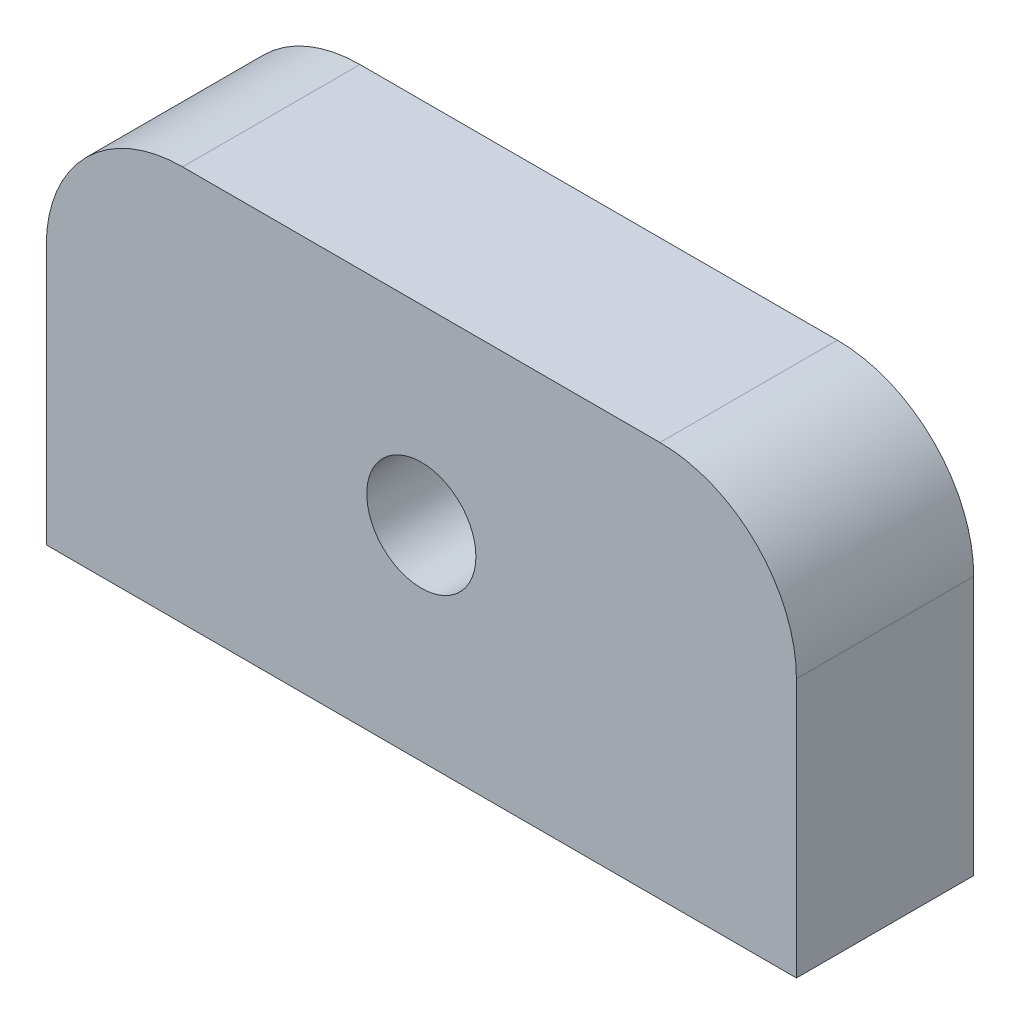
ISO-10303-21;
HEADER;
FILE_DESCRIPTION(('STEP AP214'),'2;1');
FILE_NAME('part.step','',(''),(''),'','','');
FILE_SCHEMA(('AUTOMOTIVE_DESIGN { 1 0 10303 214 1 1 1 1 }'));
ENDSEC;
DATA;
#1=APPLICATION_CONTEXT('core data for automotive mechanical design processes');
#2=APPLICATION_PROTOCOL_DEFINITION('international standard','automotive_design',2000,#1);
#3=PRODUCT_CONTEXT('',#1,'mechanical');
#4=PRODUCT('Part','Part','',(#3));
#5=PRODUCT_RELATED_PRODUCT_CATEGORY('part','',(#4));
#6=PRODUCT_DEFINITION_FORMATION('','',#4);
#7=PRODUCT_DEFINITION_CONTEXT('part definition',#1,'design');
#8=PRODUCT_DEFINITION('design','',#6,#7);
#9=PRODUCT_DEFINITION_SHAPE('','',#8);
#10=(LENGTH_UNIT() NAMED_UNIT(*) SI_UNIT(.MILLI.,.METRE.));
#11=(NAMED_UNIT(*) PLANE_ANGLE_UNIT() SI_UNIT($,.RADIAN.));
#12=(NAMED_UNIT(*) SI_UNIT($,.STERADIAN.) SOLID_ANGLE_UNIT());
#13=UNCERTAINTY_MEASURE_WITH_UNIT(LENGTH_MEASURE(1.E-05),#10,'distance_accuracy_value','');
#14=(GEOMETRIC_REPRESENTATION_CONTEXT(3) GLOBAL_UNCERTAINTY_ASSIGNED_CONTEXT((#13)) GLOBAL_UNIT_ASSIGNED_CONTEXT((#10,
#11,#12)) REPRESENTATION_CONTEXT('',''));
#15=CARTESIAN_POINT('',(0.,0.,0.));
#16=DIRECTION('',(0.,0.,1.));
#17=DIRECTION('',(1.,0.,0.));
#18=AXIS2_PLACEMENT_3D('',#15,#16,#17);
#19=CARTESIAN_POINT('',(-24.3239436619718,11.7253521126761,13.));
#20=DIRECTION('',(1.,0.,0.));
#21=DIRECTION('',(0.,0.,-1.));
#22=AXIS2_PLACEMENT_3D('',#19,#20,#21);
#23=PLANE('',#22);
#24=DIRECTION('',(0.,-1.,0.));
#25=VECTOR('',#24,1.);
#26=CARTESIAN_POINT('',(-24.3239436619718,11.7253521126761,13.));
#27=LINE('',#26,#25);
#28=CARTESIAN_POINT('',(-24.3239436619718,1.72535211267607,13.));
#29=VERTEX_POINT('',#28);
#30=CARTESIAN_POINT('',(-24.3239436619718,-17.2746478873239,13.));
#31=VERTEX_POINT('',#30);
#32=EDGE_CURVE('E93',#29,#31,#27,.T.);
#33=ORIENTED_EDGE('',*,*,#32,.F.);
#34=DIRECTION('',(0.,0.,-1.));
#35=VECTOR('',#34,1.);
#36=CARTESIAN_POINT('',(-24.3239436619718,1.72535211267606,13.));
#37=LINE('',#36,#35);
#38=CARTESIAN_POINT('',(-24.3239436619718,1.72535211267607,0.));
#39=VERTEX_POINT('',#38);
#40=EDGE_CURVE('E12',#29,#39,#37,.T.);
#41=ORIENTED_EDGE('',*,*,#40,.T.);
#42=DIRECTION('',(0.,-1.,0.));
#43=VECTOR('',#42,1.);
#44=CARTESIAN_POINT('',(-24.3239436619718,11.7253521126761,0.));
#45=LINE('',#44,#43);
#46=CARTESIAN_POINT('',(-24.3239436619718,-17.2746478873239,0.));
#47=VERTEX_POINT('',#46);
#48=EDGE_CURVE('E112',#39,#47,#45,.T.);
#49=ORIENTED_EDGE('',*,*,#48,.T.);
#50=DIRECTION('',(0.,0.,-1.));
#51=VECTOR('',#50,1.);
#52=CARTESIAN_POINT('',(-24.3239436619718,-17.2746478873239,13.));
#53=LINE('',#52,#51);
#54=EDGE_CURVE('E106',#31,#47,#53,.T.);
#55=ORIENTED_EDGE('',*,*,#54,.F.);
#56=EDGE_LOOP('',(#33,#41,#49,#55));
#57=FACE_BOUND('',#56,.T.);
#58=ADVANCED_FACE('F40',(#57),#23,.F.);
#59=CARTESIAN_POINT('',(-24.3239436619718,-17.2746478873239,13.));
#60=DIRECTION('',(0.,1.,0.));
#61=DIRECTION('',(0.,0.,1.));
#62=AXIS2_PLACEMENT_3D('',#59,#60,#61);
#63=PLANE('',#62);
#64=DIRECTION('',(1.,0.,0.));
#65=VECTOR('',#64,1.);
#66=CARTESIAN_POINT('',(-24.3239436619718,-17.2746478873239,0.));
#67=LINE('',#66,#65);
#68=CARTESIAN_POINT('',(30.6760563380282,-17.2746478873239,0.));
#69=VERTEX_POINT('',#68);
#70=EDGE_CURVE('E145',#47,#69,#67,.T.);
#71=ORIENTED_EDGE('',*,*,#70,.T.);
#72=DIRECTION('',(0.,0.,-1.));
#73=VECTOR('',#72,1.);
#74=CARTESIAN_POINT('',(30.6760563380282,-17.2746478873239,13.));
#75=LINE('',#74,#73);
#76=CARTESIAN_POINT('',(30.6760563380282,-17.2746478873239,13.));
#77=VERTEX_POINT('',#76);
#78=EDGE_CURVE('E108',#77,#69,#75,.T.);
#79=ORIENTED_EDGE('',*,*,#78,.F.);
#80=DIRECTION('',(1.,0.,0.));
#81=VECTOR('',#80,1.);
#82=CARTESIAN_POINT('',(-24.3239436619718,-17.2746478873239,13.));
#83=LINE('',#82,#81);
#84=EDGE_CURVE('E96',#31,#77,#83,.T.);
#85=ORIENTED_EDGE('',*,*,#84,.F.);
#86=ORIENTED_EDGE('',*,*,#54,.T.);
#87=EDGE_LOOP('',(#71,#79,#85,#86));
#88=FACE_BOUND('',#87,.T.);
#89=ADVANCED_FACE('F105',(#88),#63,.F.);
#90=CARTESIAN_POINT('',(30.6760563380282,11.7253521126761,13.));
#91=DIRECTION('',(-1.,0.,0.));
#92=DIRECTION('',(0.,-1.,0.));
#93=AXIS2_PLACEMENT_3D('',#90,#91,#92);
#94=PLANE('',#93);
#95=DIRECTION('',(0.,1.,0.));
#96=VECTOR('',#95,1.);
#97=CARTESIAN_POINT('',(30.6760563380282,11.7253521126761,0.));
#98=LINE('',#97,#96);
#99=CARTESIAN_POINT('',(30.6760563380282,1.72535211267607,0.));
#100=VERTEX_POINT('',#99);
#101=EDGE_CURVE('E143',#69,#100,#98,.T.);
#102=ORIENTED_EDGE('',*,*,#101,.T.);
#103=DIRECTION('',(0.,0.,-1.));
#104=VECTOR('',#103,1.);
#105=CARTESIAN_POINT('',(30.6760563380282,1.72535211267606,13.));
#106=LINE('',#105,#104);
#107=CARTESIAN_POINT('',(30.6760563380282,1.72535211267607,13.));
#108=VERTEX_POINT('',#107);
#109=EDGE_CURVE('E63',#100,#108,#106,.F.);
#110=ORIENTED_EDGE('',*,*,#109,.T.);
#111=DIRECTION('',(0.,1.,0.));
#112=VECTOR('',#111,1.);
#113=CARTESIAN_POINT('',(30.6760563380282,11.7253521126761,13.));
#114=LINE('',#113,#112);
#115=EDGE_CURVE('E109',#77,#108,#114,.T.);
#116=ORIENTED_EDGE('',*,*,#115,.F.);
#117=ORIENTED_EDGE('',*,*,#78,.T.);
#118=EDGE_LOOP('',(#102,#110,#116,#117));
#119=FACE_BOUND('',#118,.T.);
#120=ADVANCED_FACE('F144',(#119),#94,.F.);
#121=CARTESIAN_POINT('',(-24.3239436619718,11.7253521126761,13.));
#122=DIRECTION('',(0.,-1.,0.));
#123=DIRECTION('',(0.,0.,-1.));
#124=AXIS2_PLACEMENT_3D('',#121,#122,#123);
#125=PLANE('',#124);
#126=DIRECTION('',(-1.,0.,0.));
#127=VECTOR('',#126,1.);
#128=CARTESIAN_POINT('',(-24.3239436619718,11.7253521126761,13.));
#129=LINE('',#128,#127);
#130=CARTESIAN_POINT('',(20.6760563380282,11.7253521126761,13.));
#131=VERTEX_POINT('',#130);
#132=CARTESIAN_POINT('',(-14.3239436619718,11.7253521126761,13.));
#133=VERTEX_POINT('',#132);
#134=EDGE_CURVE('E118',#131,#133,#129,.T.);
#135=ORIENTED_EDGE('',*,*,#134,.F.);
#136=DIRECTION('',(0.,0.,-1.));
#137=VECTOR('',#136,1.);
#138=CARTESIAN_POINT('',(20.6760563380282,11.7253521126761,13.));
#139=LINE('',#138,#137);
#140=CARTESIAN_POINT('',(20.6760563380282,11.7253521126761,0.));
#141=VERTEX_POINT('',#140);
#142=EDGE_CURVE('E116',#131,#141,#139,.T.);
#143=ORIENTED_EDGE('',*,*,#142,.T.);
#144=DIRECTION('',(-1.,0.,0.));
#145=VECTOR('',#144,1.);
#146=CARTESIAN_POINT('',(-24.3239436619718,11.7253521126761,0.));
#147=LINE('',#146,#145);
#148=CARTESIAN_POINT('',(-14.3239436619718,11.7253521126761,0.));
#149=VERTEX_POINT('',#148);
#150=EDGE_CURVE('E101',#141,#149,#147,.T.);
#151=ORIENTED_EDGE('',*,*,#150,.T.);
#152=DIRECTION('',(0.,0.,-1.));
#153=VECTOR('',#152,1.);
#154=CARTESIAN_POINT('',(-14.3239436619718,11.7253521126761,13.));
#155=LINE('',#154,#153);
#156=EDGE_CURVE('E114',#149,#133,#155,.F.);
#157=ORIENTED_EDGE('',*,*,#156,.T.);
#158=EDGE_LOOP('',(#135,#143,#151,#157));
#159=FACE_BOUND('',#158,.T.);
#160=ADVANCED_FACE('F134',(#159),#125,.F.);
#161=CARTESIAN_POINT('',(0.,0.,13.));
#162=DIRECTION('',(0.,0.,1.));
#163=DIRECTION('',(1.,0.,0.));
#164=AXIS2_PLACEMENT_3D('',#161,#162,#163);
#165=PLANE('',#164);
#166=CARTESIAN_POINT('',(3.17605633802817,-2.27464788732394,13.));
#167=DIRECTION('',(0.,0.,1.));
#168=DIRECTION('',(1.,0.,0.));
#169=AXIS2_PLACEMENT_3D('',#166,#167,#168);
#170=CIRCLE('',#169,4.);
#171=CARTESIAN_POINT('',(7.17605633802818,-2.27464788732394,13.));
#172=VERTEX_POINT('',#171);
#173=EDGE_CURVE('E152',#172,#172,#170,.T.);
#174=ORIENTED_EDGE('',*,*,#173,.F.);
#175=EDGE_LOOP('',(#174));
#176=FACE_BOUND('',#175,.T.);
#177=ORIENTED_EDGE('',*,*,#115,.T.);
#178=CARTESIAN_POINT('',(20.6760563380282,1.72535211267606,13.));
#179=DIRECTION('',(0.,0.,1.));
#180=DIRECTION('',(1.,0.,0.));
#181=AXIS2_PLACEMENT_3D('',#178,#179,#180);
#182=CIRCLE('',#181,10.);
#183=EDGE_CURVE('E48',#108,#131,#182,.T.);
#184=ORIENTED_EDGE('',*,*,#183,.T.);
#185=ORIENTED_EDGE('',*,*,#134,.T.);
#186=CARTESIAN_POINT('',(-14.3239436619718,1.72535211267606,13.));
#187=DIRECTION('',(0.,0.,1.));
#188=DIRECTION('',(1.,0.,0.));
#189=AXIS2_PLACEMENT_3D('',#186,#187,#188);
#190=CIRCLE('',#189,10.);
#191=EDGE_CURVE('E55',#133,#29,#190,.T.);
#192=ORIENTED_EDGE('',*,*,#191,.T.);
#193=ORIENTED_EDGE('',*,*,#32,.T.);
#194=ORIENTED_EDGE('',*,*,#84,.T.);
#195=EDGE_LOOP('',(#177,#184,#185,#192,#193,#194));
#196=FACE_BOUND('',#195,.T.);
#197=ADVANCED_FACE('F95',(#176,#196),#165,.T.);
#198=CARTESIAN_POINT('',(0.,0.,0.));
#199=DIRECTION('',(0.,0.,1.));
#200=DIRECTION('',(1.,0.,0.));
#201=AXIS2_PLACEMENT_3D('',#198,#199,#200);
#202=PLANE('',#201);
#203=CARTESIAN_POINT('',(3.17605633802817,-2.27464788732394,0.));
#204=DIRECTION('',(0.,0.,1.));
#205=DIRECTION('',(1.,0.,0.));
#206=AXIS2_PLACEMENT_3D('',#203,#204,#205);
#207=CIRCLE('',#206,4.);
#208=CARTESIAN_POINT('',(7.17605633802818,-2.27464788732394,0.));
#209=VERTEX_POINT('',#208);
#210=EDGE_CURVE('E149',#209,#209,#207,.T.);
#211=ORIENTED_EDGE('',*,*,#210,.T.);
#212=EDGE_LOOP('',(#211));
#213=FACE_BOUND('',#212,.T.);
#214=ORIENTED_EDGE('',*,*,#150,.F.);
#215=CARTESIAN_POINT('',(20.6760563380282,1.72535211267606,0.));
#216=DIRECTION('',(0.,0.,1.));
#217=DIRECTION('',(1.,0.,0.));
#218=AXIS2_PLACEMENT_3D('',#215,#216,#217);
#219=CIRCLE('',#218,10.);
#220=EDGE_CURVE('E126',#141,#100,#219,.F.);
#221=ORIENTED_EDGE('',*,*,#220,.T.);
#222=ORIENTED_EDGE('',*,*,#101,.F.);
#223=ORIENTED_EDGE('',*,*,#70,.F.);
#224=ORIENTED_EDGE('',*,*,#48,.F.);
#225=CARTESIAN_POINT('',(-14.3239436619718,1.72535211267606,0.));
#226=DIRECTION('',(0.,0.,1.));
#227=DIRECTION('',(1.,0.,0.));
#228=AXIS2_PLACEMENT_3D('',#225,#226,#227);
#229=CIRCLE('',#228,10.);
#230=EDGE_CURVE('E124',#39,#149,#229,.F.);
#231=ORIENTED_EDGE('',*,*,#230,.T.);
#232=EDGE_LOOP('',(#214,#221,#222,#223,#224,#231));
#233=FACE_BOUND('',#232,.T.);
#234=ADVANCED_FACE('F142',(#213,#233),#202,.F.);
#235=CARTESIAN_POINT('',(3.17605633802817,-2.27464788732394,0.));
#236=DIRECTION('',(0.,0.,1.));
#237=DIRECTION('',(1.,0.,0.));
#238=AXIS2_PLACEMENT_3D('',#235,#236,#237);
#239=CYLINDRICAL_SURFACE('',#238,4.);
#240=ORIENTED_EDGE('',*,*,#210,.F.);
#241=EDGE_LOOP('',(#240));
#242=FACE_BOUND('',#241,.T.);
#243=ORIENTED_EDGE('',*,*,#173,.T.);
#244=EDGE_LOOP('',(#243));
#245=FACE_BOUND('',#244,.T.);
#246=ADVANCED_FACE('F159',(#242,#245),#239,.F.);
#247=CARTESIAN_POINT('',(20.6760563380282,1.72535211267606,13.));
#248=DIRECTION('',(0.,0.,-1.));
#249=DIRECTION('',(-1.,0.,0.));
#250=AXIS2_PLACEMENT_3D('',#247,#248,#249);
#251=CYLINDRICAL_SURFACE('',#250,10.);
#252=ORIENTED_EDGE('',*,*,#183,.F.);
#253=ORIENTED_EDGE('',*,*,#109,.F.);
#254=ORIENTED_EDGE('',*,*,#220,.F.);
#255=ORIENTED_EDGE('',*,*,#142,.F.);
#256=EDGE_LOOP('',(#252,#253,#254,#255));
#257=FACE_BOUND('',#256,.T.);
#258=ADVANCED_FACE('F139',(#257),#251,.T.);
#259=CARTESIAN_POINT('',(-14.3239436619718,1.72535211267606,13.));
#260=DIRECTION('',(0.,0.,-1.));
#261=DIRECTION('',(-1.,0.,0.));
#262=AXIS2_PLACEMENT_3D('',#259,#260,#261);
#263=CYLINDRICAL_SURFACE('',#262,10.);
#264=ORIENTED_EDGE('',*,*,#191,.F.);
#265=ORIENTED_EDGE('',*,*,#156,.F.);
#266=ORIENTED_EDGE('',*,*,#230,.F.);
#267=ORIENTED_EDGE('',*,*,#40,.F.);
#268=EDGE_LOOP('',(#264,#265,#266,#267));
#269=FACE_BOUND('',#268,.T.);
#270=ADVANCED_FACE('F42',(#269),#263,.T.);
#271=CLOSED_SHELL('',(#58,#89,#120,#160,#197,#234,#246,#258,#270));
#272=MANIFOLD_SOLID_BREP('B2',#271);
#273=ADVANCED_BREP_SHAPE_REPRESENTATION('',(#18,#272),#14);
#274=SHAPE_DEFINITION_REPRESENTATION(#9,#273);
ENDSEC;
END-ISO-10303-21;
